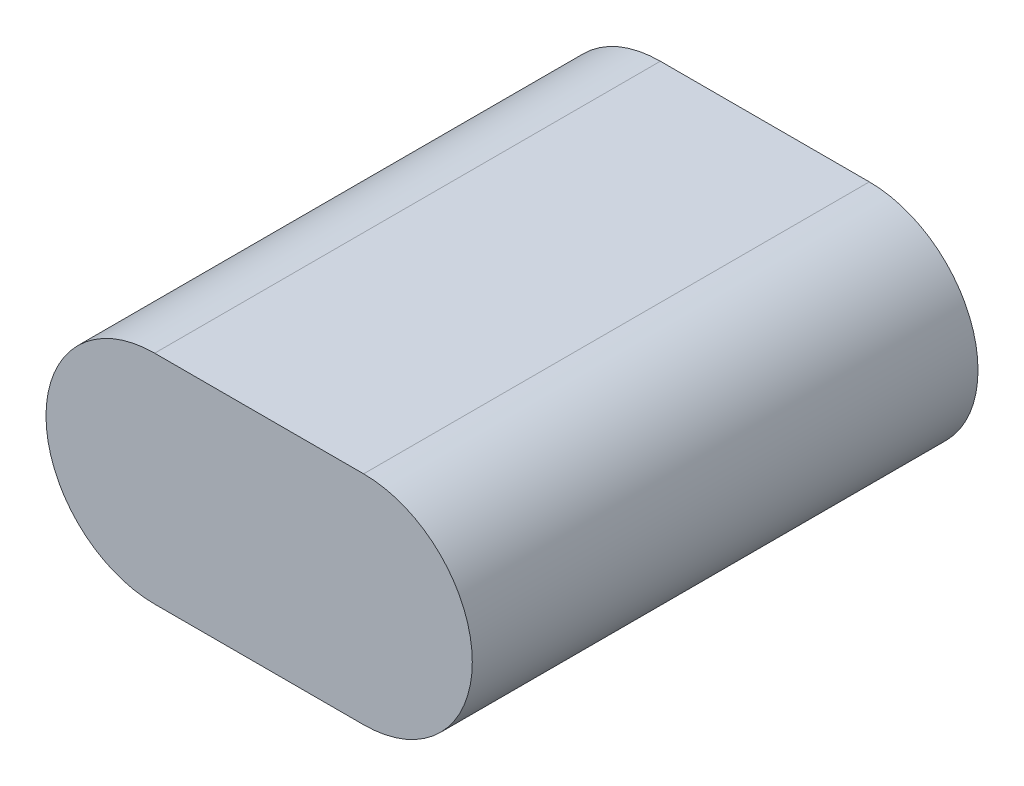
ISO-10303-21;
HEADER;
FILE_DESCRIPTION(('STEP AP214'),'2;1');
FILE_NAME('part.step','',(''),(''),'','','');
FILE_SCHEMA(('AUTOMOTIVE_DESIGN { 1 0 10303 214 1 1 1 1 }'));
ENDSEC;
DATA;
#1=APPLICATION_CONTEXT('core data for automotive mechanical design processes');
#2=APPLICATION_PROTOCOL_DEFINITION('international standard','automotive_design',2000,#1);
#3=PRODUCT_CONTEXT('',#1,'mechanical');
#4=PRODUCT('Part','Part','',(#3));
#5=PRODUCT_RELATED_PRODUCT_CATEGORY('part','',(#4));
#6=PRODUCT_DEFINITION_FORMATION('','',#4);
#7=PRODUCT_DEFINITION_CONTEXT('part definition',#1,'design');
#8=PRODUCT_DEFINITION('design','',#6,#7);
#9=PRODUCT_DEFINITION_SHAPE('','',#8);
#10=(LENGTH_UNIT() NAMED_UNIT(*) SI_UNIT(.MILLI.,.METRE.));
#11=(NAMED_UNIT(*) PLANE_ANGLE_UNIT() SI_UNIT($,.RADIAN.));
#12=(NAMED_UNIT(*) SI_UNIT($,.STERADIAN.) SOLID_ANGLE_UNIT());
#13=UNCERTAINTY_MEASURE_WITH_UNIT(LENGTH_MEASURE(1.E-05),#10,'distance_accuracy_value','');
#14=(GEOMETRIC_REPRESENTATION_CONTEXT(3) GLOBAL_UNCERTAINTY_ASSIGNED_CONTEXT((#13)) GLOBAL_UNIT_ASSIGNED_CONTEXT((#10,
#11,#12)) REPRESENTATION_CONTEXT('',''));
#15=CARTESIAN_POINT('',(0.,0.,0.));
#16=DIRECTION('',(0.,0.,1.));
#17=DIRECTION('',(1.,0.,0.));
#18=AXIS2_PLACEMENT_3D('',#15,#16,#17);
#19=CARTESIAN_POINT('',(-50.,0.,242.));
#20=DIRECTION('',(0.,0.,-1.));
#21=DIRECTION('',(-1.,0.,0.));
#22=AXIS2_PLACEMENT_3D('',#19,#20,#21);
#23=CYLINDRICAL_SURFACE('',#22,52.);
#24=CARTESIAN_POINT('',(-50.,0.,0.));
#25=DIRECTION('',(0.,0.,1.));
#26=DIRECTION('',(1.,0.,0.));
#27=AXIS2_PLACEMENT_3D('',#24,#25,#26);
#28=CIRCLE('',#27,52.);
#29=CARTESIAN_POINT('',(-50.,52.,0.));
#30=VERTEX_POINT('',#29);
#31=CARTESIAN_POINT('',(-50.,-52.,0.));
#32=VERTEX_POINT('',#31);
#33=EDGE_CURVE('E109',#30,#32,#28,.T.);
#34=ORIENTED_EDGE('',*,*,#33,.T.);
#35=DIRECTION('',(0.,0.,-1.));
#36=VECTOR('',#35,1.);
#37=CARTESIAN_POINT('',(-50.,-52.,242.));
#38=LINE('',#37,#36);
#39=CARTESIAN_POINT('',(-50.,-52.,242.));
#40=VERTEX_POINT('',#39);
#41=EDGE_CURVE('E11',#40,#32,#38,.T.);
#42=ORIENTED_EDGE('',*,*,#41,.F.);
#43=CARTESIAN_POINT('',(-50.,0.,242.));
#44=DIRECTION('',(0.,0.,1.));
#45=DIRECTION('',(1.,0.,0.));
#46=AXIS2_PLACEMENT_3D('',#43,#44,#45);
#47=CIRCLE('',#46,52.);
#48=CARTESIAN_POINT('',(-50.,52.,242.));
#49=VERTEX_POINT('',#48);
#50=EDGE_CURVE('E92',#49,#40,#47,.T.);
#51=ORIENTED_EDGE('',*,*,#50,.F.);
#52=DIRECTION('',(0.,0.,-1.));
#53=VECTOR('',#52,1.);
#54=CARTESIAN_POINT('',(-50.,52.,242.));
#55=LINE('',#54,#53);
#56=EDGE_CURVE('E105',#49,#30,#55,.T.);
#57=ORIENTED_EDGE('',*,*,#56,.T.);
#58=EDGE_LOOP('',(#34,#42,#51,#57));
#59=FACE_BOUND('',#58,.T.);
#60=ADVANCED_FACE('F40',(#59),#23,.T.);
#61=CARTESIAN_POINT('',(-50.,-52.,242.));
#62=DIRECTION('',(0.,1.,0.));
#63=DIRECTION('',(0.,0.,1.));
#64=AXIS2_PLACEMENT_3D('',#61,#62,#63);
#65=PLANE('',#64);
#66=DIRECTION('',(1.,0.,0.));
#67=VECTOR('',#66,1.);
#68=CARTESIAN_POINT('',(-50.,-52.,0.));
#69=LINE('',#68,#67);
#70=CARTESIAN_POINT('',(50.,-52.,0.));
#71=VERTEX_POINT('',#70);
#72=EDGE_CURVE('E97',#32,#71,#69,.T.);
#73=ORIENTED_EDGE('',*,*,#72,.T.);
#74=DIRECTION('',(0.,0.,-1.));
#75=VECTOR('',#74,1.);
#76=CARTESIAN_POINT('',(50.,-52.,242.));
#77=LINE('',#76,#75);
#78=CARTESIAN_POINT('',(50.,-52.,242.));
#79=VERTEX_POINT('',#78);
#80=EDGE_CURVE('E49',#79,#71,#77,.T.);
#81=ORIENTED_EDGE('',*,*,#80,.F.);
#82=DIRECTION('',(1.,0.,0.));
#83=VECTOR('',#82,1.);
#84=CARTESIAN_POINT('',(-50.,-52.,242.));
#85=LINE('',#84,#83);
#86=EDGE_CURVE('E87',#40,#79,#85,.T.);
#87=ORIENTED_EDGE('',*,*,#86,.F.);
#88=ORIENTED_EDGE('',*,*,#41,.T.);
#89=EDGE_LOOP('',(#73,#81,#87,#88));
#90=FACE_BOUND('',#89,.T.);
#91=ADVANCED_FACE('F96',(#90),#65,.F.);
#92=CARTESIAN_POINT('',(50.,0.,242.));
#93=DIRECTION('',(0.,0.,-1.));
#94=DIRECTION('',(-1.,0.,0.));
#95=AXIS2_PLACEMENT_3D('',#92,#93,#94);
#96=CYLINDRICAL_SURFACE('',#95,52.);
#97=CARTESIAN_POINT('',(50.,0.,0.));
#98=DIRECTION('',(0.,0.,1.));
#99=DIRECTION('',(-1.,0.,0.));
#100=AXIS2_PLACEMENT_3D('',#97,#98,#99);
#101=CIRCLE('',#100,52.);
#102=CARTESIAN_POINT('',(50.,52.,0.));
#103=VERTEX_POINT('',#102);
#104=EDGE_CURVE('E74',#71,#103,#101,.T.);
#105=ORIENTED_EDGE('',*,*,#104,.T.);
#106=DIRECTION('',(0.,0.,-1.));
#107=VECTOR('',#106,1.);
#108=CARTESIAN_POINT('',(50.,52.,242.));
#109=LINE('',#108,#107);
#110=CARTESIAN_POINT('',(50.,52.,242.));
#111=VERTEX_POINT('',#110);
#112=EDGE_CURVE('E99',#111,#103,#109,.T.);
#113=ORIENTED_EDGE('',*,*,#112,.F.);
#114=CARTESIAN_POINT('',(50.,0.,242.));
#115=DIRECTION('',(0.,0.,1.));
#116=DIRECTION('',(-1.,0.,0.));
#117=AXIS2_PLACEMENT_3D('',#114,#115,#116);
#118=CIRCLE('',#117,52.);
#119=EDGE_CURVE('E90',#79,#111,#118,.T.);
#120=ORIENTED_EDGE('',*,*,#119,.F.);
#121=ORIENTED_EDGE('',*,*,#80,.T.);
#122=EDGE_LOOP('',(#105,#113,#120,#121));
#123=FACE_BOUND('',#122,.T.);
#124=ADVANCED_FACE('F100',(#123),#96,.T.);
#125=CARTESIAN_POINT('',(-50.,52.,242.));
#126=DIRECTION('',(0.,-1.,0.));
#127=DIRECTION('',(0.,0.,-1.));
#128=AXIS2_PLACEMENT_3D('',#125,#126,#127);
#129=PLANE('',#128);
#130=DIRECTION('',(-1.,0.,0.));
#131=VECTOR('',#130,1.);
#132=CARTESIAN_POINT('',(-50.,52.,0.));
#133=LINE('',#132,#131);
#134=EDGE_CURVE('E80',#103,#30,#133,.T.);
#135=ORIENTED_EDGE('',*,*,#134,.T.);
#136=ORIENTED_EDGE('',*,*,#56,.F.);
#137=DIRECTION('',(-1.,0.,0.));
#138=VECTOR('',#137,1.);
#139=CARTESIAN_POINT('',(-50.,52.,242.));
#140=LINE('',#139,#138);
#141=EDGE_CURVE('E57',#111,#49,#140,.T.);
#142=ORIENTED_EDGE('',*,*,#141,.F.);
#143=ORIENTED_EDGE('',*,*,#112,.T.);
#144=EDGE_LOOP('',(#135,#136,#142,#143));
#145=FACE_BOUND('',#144,.T.);
#146=ADVANCED_FACE('F121',(#145),#129,.F.);
#147=CARTESIAN_POINT('',(-50.,0.,242.));
#148=DIRECTION('',(0.,0.,1.));
#149=DIRECTION('',(1.,0.,0.));
#150=AXIS2_PLACEMENT_3D('',#147,#148,#149);
#151=PLANE('',#150);
#152=ORIENTED_EDGE('',*,*,#50,.T.);
#153=ORIENTED_EDGE('',*,*,#86,.T.);
#154=ORIENTED_EDGE('',*,*,#119,.T.);
#155=ORIENTED_EDGE('',*,*,#141,.T.);
#156=EDGE_LOOP('',(#152,#153,#154,#155));
#157=FACE_BOUND('',#156,.T.);
#158=ADVANCED_FACE('F88',(#157),#151,.T.);
#159=CARTESIAN_POINT('',(-50.,0.,0.));
#160=DIRECTION('',(0.,0.,1.));
#161=DIRECTION('',(1.,0.,0.));
#162=AXIS2_PLACEMENT_3D('',#159,#160,#161);
#163=PLANE('',#162);
#164=ORIENTED_EDGE('',*,*,#33,.F.);
#165=ORIENTED_EDGE('',*,*,#134,.F.);
#166=ORIENTED_EDGE('',*,*,#104,.F.);
#167=ORIENTED_EDGE('',*,*,#72,.F.);
#168=EDGE_LOOP('',(#164,#165,#166,#167));
#169=FACE_BOUND('',#168,.T.);
#170=ADVANCED_FACE('F124',(#169),#163,.F.);
#171=CLOSED_SHELL('',(#60,#91,#124,#146,#158,#170));
#172=MANIFOLD_SOLID_BREP('B2',#171);
#173=ADVANCED_BREP_SHAPE_REPRESENTATION('',(#18,#172),#14);
#174=SHAPE_DEFINITION_REPRESENTATION(#9,#173);
ENDSEC;
END-ISO-10303-21;
